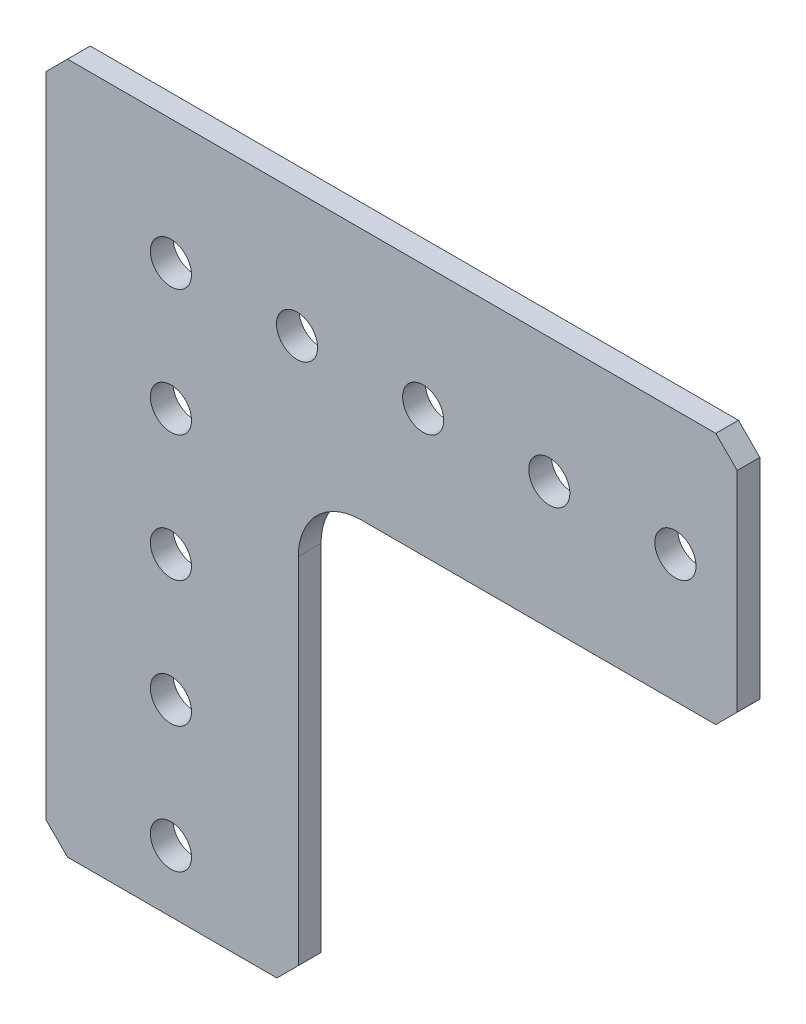
ISO-10303-21;
HEADER;
FILE_DESCRIPTION(('STEP AP214'),'2;1');
FILE_NAME('part.step','',(''),(''),'','','');
FILE_SCHEMA(('AUTOMOTIVE_DESIGN { 1 0 10303 214 1 1 1 1 }'));
ENDSEC;
DATA;
#1=APPLICATION_CONTEXT('core data for automotive mechanical design processes');
#2=APPLICATION_PROTOCOL_DEFINITION('international standard','automotive_design',2000,#1);
#3=PRODUCT_CONTEXT('',#1,'mechanical');
#4=PRODUCT('Part','Part','',(#3));
#5=PRODUCT_RELATED_PRODUCT_CATEGORY('part','',(#4));
#6=PRODUCT_DEFINITION_FORMATION('','',#4);
#7=PRODUCT_DEFINITION_CONTEXT('part definition',#1,'design');
#8=PRODUCT_DEFINITION('design','',#6,#7);
#9=PRODUCT_DEFINITION_SHAPE('','',#8);
#10=(LENGTH_UNIT() NAMED_UNIT(*) SI_UNIT(.MILLI.,.METRE.));
#11=(NAMED_UNIT(*) PLANE_ANGLE_UNIT() SI_UNIT($,.RADIAN.));
#12=(NAMED_UNIT(*) SI_UNIT($,.STERADIAN.) SOLID_ANGLE_UNIT());
#13=UNCERTAINTY_MEASURE_WITH_UNIT(LENGTH_MEASURE(1.E-05),#10,'distance_accuracy_value','');
#14=(GEOMETRIC_REPRESENTATION_CONTEXT(3) GLOBAL_UNCERTAINTY_ASSIGNED_CONTEXT((#13)) GLOBAL_UNIT_ASSIGNED_CONTEXT((#10,
#11,#12)) REPRESENTATION_CONTEXT('',''));
#15=CARTESIAN_POINT('',(0.,0.,0.));
#16=DIRECTION('',(0.,0.,1.));
#17=DIRECTION('',(1.,0.,0.));
#18=AXIS2_PLACEMENT_3D('',#15,#16,#17);
#19=CARTESIAN_POINT('',(-12.573,10.414,2.286));
#20=DIRECTION('',(-0.707106781186548,0.707106781186547,0.));
#21=DIRECTION('',(-0.707106781186547,-0.707106781186548,0.));
#22=AXIS2_PLACEMENT_3D('',#19,#20,#21);
#23=PLANE('',#22);
#24=DIRECTION('',(0.707106781186547,0.707106781186548,0.));
#25=VECTOR('',#24,1.);
#26=CARTESIAN_POINT('',(-12.573,10.414,0.));
#27=LINE('',#26,#25);
#28=CARTESIAN_POINT('',(-12.573,10.414,0.));
#29=VERTEX_POINT('',#28);
#30=CARTESIAN_POINT('',(-10.414,12.573,0.));
#31=VERTEX_POINT('',#30);
#32=EDGE_CURVE('E157',#29,#31,#27,.T.);
#33=ORIENTED_EDGE('',*,*,#32,.F.);
#34=DIRECTION('',(0.,0.,-1.));
#35=VECTOR('',#34,1.);
#36=CARTESIAN_POINT('',(-12.573,10.414,2.286));
#37=LINE('',#36,#35);
#38=CARTESIAN_POINT('',(-12.573,10.414,2.286));
#39=VERTEX_POINT('',#38);
#40=EDGE_CURVE('E11',#39,#29,#37,.T.);
#41=ORIENTED_EDGE('',*,*,#40,.F.);
#42=DIRECTION('',(0.707106781186547,0.707106781186548,0.));
#43=VECTOR('',#42,1.);
#44=CARTESIAN_POINT('',(-12.573,10.414,2.286));
#45=LINE('',#44,#43);
#46=CARTESIAN_POINT('',(-10.414,12.573,2.286));
#47=VERTEX_POINT('',#46);
#48=EDGE_CURVE('E190',#39,#47,#45,.T.);
#49=ORIENTED_EDGE('',*,*,#48,.T.);
#50=DIRECTION('',(0.,0.,-1.));
#51=VECTOR('',#50,1.);
#52=CARTESIAN_POINT('',(-10.414,12.573,2.286));
#53=LINE('',#52,#51);
#54=EDGE_CURVE('E39',#47,#31,#53,.T.);
#55=ORIENTED_EDGE('',*,*,#54,.T.);
#56=EDGE_LOOP('',(#33,#41,#49,#55));
#57=FACE_BOUND('',#56,.T.);
#58=ADVANCED_FACE('F36',(#57),#23,.T.);
#59=CARTESIAN_POINT('',(-12.573,-54.864,2.286));
#60=DIRECTION('',(-1.,0.,0.));
#61=DIRECTION('',(0.,-1.,0.));
#62=AXIS2_PLACEMENT_3D('',#59,#60,#61);
#63=PLANE('',#62);
#64=DIRECTION('',(0.,1.,0.));
#65=VECTOR('',#64,1.);
#66=CARTESIAN_POINT('',(-12.573,-54.864,0.));
#67=LINE('',#66,#65);
#68=CARTESIAN_POINT('',(-12.573,-54.864,0.));
#69=VERTEX_POINT('',#68);
#70=EDGE_CURVE('E188',#69,#29,#67,.T.);
#71=ORIENTED_EDGE('',*,*,#70,.F.);
#72=DIRECTION('',(0.,0.,-1.));
#73=VECTOR('',#72,1.);
#74=CARTESIAN_POINT('',(-12.573,-54.864,2.286));
#75=LINE('',#74,#73);
#76=CARTESIAN_POINT('',(-12.573,-54.864,2.286));
#77=VERTEX_POINT('',#76);
#78=EDGE_CURVE('E45',#77,#69,#75,.T.);
#79=ORIENTED_EDGE('',*,*,#78,.F.);
#80=DIRECTION('',(0.,1.,0.));
#81=VECTOR('',#80,1.);
#82=CARTESIAN_POINT('',(-12.573,-54.864,2.286));
#83=LINE('',#82,#81);
#84=EDGE_CURVE('E147',#77,#39,#83,.T.);
#85=ORIENTED_EDGE('',*,*,#84,.T.);
#86=ORIENTED_EDGE('',*,*,#40,.T.);
#87=EDGE_LOOP('',(#71,#79,#85,#86));
#88=FACE_BOUND('',#87,.T.);
#89=ADVANCED_FACE('F210',(#88),#63,.T.);
#90=CARTESIAN_POINT('',(-10.414,-57.023,2.286));
#91=DIRECTION('',(-0.707106781186544,-0.707106781186551,0.));
#92=DIRECTION('',(0.707106781186551,-0.707106781186544,0.));
#93=AXIS2_PLACEMENT_3D('',#90,#91,#92);
#94=PLANE('',#93);
#95=DIRECTION('',(-0.707106781186551,0.707106781186544,0.));
#96=VECTOR('',#95,1.);
#97=CARTESIAN_POINT('',(-10.414,-57.023,0.));
#98=LINE('',#97,#96);
#99=CARTESIAN_POINT('',(-10.414,-57.023,0.));
#100=VERTEX_POINT('',#99);
#101=EDGE_CURVE('E134',#100,#69,#98,.T.);
#102=ORIENTED_EDGE('',*,*,#101,.F.);
#103=DIRECTION('',(0.,0.,-1.));
#104=VECTOR('',#103,1.);
#105=CARTESIAN_POINT('',(-10.414,-57.023,2.286));
#106=LINE('',#105,#104);
#107=CARTESIAN_POINT('',(-10.414,-57.023,2.286));
#108=VERTEX_POINT('',#107);
#109=EDGE_CURVE('E129',#108,#100,#106,.T.);
#110=ORIENTED_EDGE('',*,*,#109,.F.);
#111=DIRECTION('',(-0.707106781186551,0.707106781186544,0.));
#112=VECTOR('',#111,1.);
#113=CARTESIAN_POINT('',(-10.414,-57.023,2.286));
#114=LINE('',#113,#112);
#115=EDGE_CURVE('E132',#108,#77,#114,.T.);
#116=ORIENTED_EDGE('',*,*,#115,.T.);
#117=ORIENTED_EDGE('',*,*,#78,.T.);
#118=EDGE_LOOP('',(#102,#110,#116,#117));
#119=FACE_BOUND('',#118,.T.);
#120=ADVANCED_FACE('F131',(#119),#94,.T.);
#121=CARTESIAN_POINT('',(10.668,-57.023,2.286));
#122=DIRECTION('',(0.,-1.,0.));
#123=DIRECTION('',(1.,0.,0.));
#124=AXIS2_PLACEMENT_3D('',#121,#122,#123);
#125=PLANE('',#124);
#126=DIRECTION('',(-1.,0.,0.));
#127=VECTOR('',#126,1.);
#128=CARTESIAN_POINT('',(10.668,-57.023,0.));
#129=LINE('',#128,#127);
#130=CARTESIAN_POINT('',(10.668,-57.023,0.));
#131=VERTEX_POINT('',#130);
#132=EDGE_CURVE('E185',#131,#100,#129,.T.);
#133=ORIENTED_EDGE('',*,*,#132,.F.);
#134=DIRECTION('',(0.,0.,-1.));
#135=VECTOR('',#134,1.);
#136=CARTESIAN_POINT('',(10.668,-57.023,2.286));
#137=LINE('',#136,#135);
#138=CARTESIAN_POINT('',(10.668,-57.023,2.286));
#139=VERTEX_POINT('',#138);
#140=EDGE_CURVE('E139',#139,#131,#137,.T.);
#141=ORIENTED_EDGE('',*,*,#140,.F.);
#142=DIRECTION('',(-1.,0.,0.));
#143=VECTOR('',#142,1.);
#144=CARTESIAN_POINT('',(10.668,-57.023,2.286));
#145=LINE('',#144,#143);
#146=EDGE_CURVE('E145',#139,#108,#145,.T.);
#147=ORIENTED_EDGE('',*,*,#146,.T.);
#148=ORIENTED_EDGE('',*,*,#109,.T.);
#149=EDGE_LOOP('',(#133,#141,#147,#148));
#150=FACE_BOUND('',#149,.T.);
#151=ADVANCED_FACE('F149',(#150),#125,.T.);
#152=CARTESIAN_POINT('',(12.827,-54.864,2.286));
#153=DIRECTION('',(0.707106781186548,-0.707106781186547,0.));
#154=DIRECTION('',(0.707106781186547,0.707106781186548,0.));
#155=AXIS2_PLACEMENT_3D('',#152,#153,#154);
#156=PLANE('',#155);
#157=DIRECTION('',(-0.707106781186547,-0.707106781186548,0.));
#158=VECTOR('',#157,1.);
#159=CARTESIAN_POINT('',(12.827,-54.864,0.));
#160=LINE('',#159,#158);
#161=CARTESIAN_POINT('',(12.827,-54.864,0.));
#162=VERTEX_POINT('',#161);
#163=EDGE_CURVE('E182',#162,#131,#160,.T.);
#164=ORIENTED_EDGE('',*,*,#163,.F.);
#165=DIRECTION('',(0.,0.,-1.));
#166=VECTOR('',#165,1.);
#167=CARTESIAN_POINT('',(12.827,-54.864,2.286));
#168=LINE('',#167,#166);
#169=CARTESIAN_POINT('',(12.827,-54.864,2.286));
#170=VERTEX_POINT('',#169);
#171=EDGE_CURVE('E194',#170,#162,#168,.T.);
#172=ORIENTED_EDGE('',*,*,#171,.F.);
#173=DIRECTION('',(-0.707106781186547,-0.707106781186548,0.));
#174=VECTOR('',#173,1.);
#175=CARTESIAN_POINT('',(12.827,-54.864,2.286));
#176=LINE('',#175,#174);
#177=EDGE_CURVE('E150',#170,#139,#176,.T.);
#178=ORIENTED_EDGE('',*,*,#177,.T.);
#179=ORIENTED_EDGE('',*,*,#140,.T.);
#180=EDGE_LOOP('',(#164,#172,#178,#179));
#181=FACE_BOUND('',#180,.T.);
#182=ADVANCED_FACE('F223',(#181),#156,.T.);
#183=CARTESIAN_POINT('',(12.827,-19.177,2.286));
#184=DIRECTION('',(1.,0.,0.));
#185=DIRECTION('',(0.,0.,-1.));
#186=AXIS2_PLACEMENT_3D('',#183,#184,#185);
#187=PLANE('',#186);
#188=DIRECTION('',(0.,-1.,0.));
#189=VECTOR('',#188,1.);
#190=CARTESIAN_POINT('',(12.827,-19.177,0.));
#191=LINE('',#190,#189);
#192=CARTESIAN_POINT('',(12.827,-19.177,0.));
#193=VERTEX_POINT('',#192);
#194=EDGE_CURVE('E179',#193,#162,#191,.T.);
#195=ORIENTED_EDGE('',*,*,#194,.F.);
#196=DIRECTION('',(0.,0.,-1.));
#197=VECTOR('',#196,1.);
#198=CARTESIAN_POINT('',(12.827,-19.177,2.286));
#199=LINE('',#198,#197);
#200=CARTESIAN_POINT('',(12.827,-19.177,2.286));
#201=VERTEX_POINT('',#200);
#202=EDGE_CURVE('E196',#201,#193,#199,.T.);
#203=ORIENTED_EDGE('',*,*,#202,.F.);
#204=DIRECTION('',(0.,-1.,0.));
#205=VECTOR('',#204,1.);
#206=CARTESIAN_POINT('',(12.827,-19.177,2.286));
#207=LINE('',#206,#205);
#208=EDGE_CURVE('E152',#201,#170,#207,.T.);
#209=ORIENTED_EDGE('',*,*,#208,.T.);
#210=ORIENTED_EDGE('',*,*,#171,.T.);
#211=EDGE_LOOP('',(#195,#203,#209,#210));
#212=FACE_BOUND('',#211,.T.);
#213=ADVANCED_FACE('F226',(#212),#187,.T.);
#214=CARTESIAN_POINT('',(19.177,-19.177,2.286));
#215=DIRECTION('',(0.,0.,-1.));
#216=DIRECTION('',(-1.,0.,0.));
#217=AXIS2_PLACEMENT_3D('',#214,#215,#216);
#218=CYLINDRICAL_SURFACE('',#217,6.35);
#219=CARTESIAN_POINT('',(19.177,-19.177,0.));
#220=DIRECTION('',(0.,0.,1.));
#221=DIRECTION('',(1.,0.,0.));
#222=AXIS2_PLACEMENT_3D('',#219,#220,#221);
#223=CIRCLE('',#222,6.35);
#224=CARTESIAN_POINT('',(19.177,-12.827,0.));
#225=VERTEX_POINT('',#224);
#226=EDGE_CURVE('E176',#225,#193,#223,.T.);
#227=ORIENTED_EDGE('',*,*,#226,.F.);
#228=DIRECTION('',(0.,0.,-1.));
#229=VECTOR('',#228,1.);
#230=CARTESIAN_POINT('',(19.177,-12.827,2.286));
#231=LINE('',#230,#229);
#232=CARTESIAN_POINT('',(19.177,-12.827,2.286));
#233=VERTEX_POINT('',#232);
#234=EDGE_CURVE('E198',#233,#225,#231,.T.);
#235=ORIENTED_EDGE('',*,*,#234,.F.);
#236=CARTESIAN_POINT('',(19.177,-19.177,2.286));
#237=DIRECTION('',(0.,0.,1.));
#238=DIRECTION('',(1.,0.,0.));
#239=AXIS2_PLACEMENT_3D('',#236,#237,#238);
#240=CIRCLE('',#239,6.35);
#241=EDGE_CURVE('E370',#233,#201,#240,.T.);
#242=ORIENTED_EDGE('',*,*,#241,.T.);
#243=ORIENTED_EDGE('',*,*,#202,.T.);
#244=EDGE_LOOP('',(#227,#235,#242,#243));
#245=FACE_BOUND('',#244,.T.);
#246=ADVANCED_FACE('F230',(#245),#218,.F.);
#247=CARTESIAN_POINT('',(54.864,-12.827,2.286));
#248=DIRECTION('',(0.,-1.,0.));
#249=DIRECTION('',(0.,0.,-1.));
#250=AXIS2_PLACEMENT_3D('',#247,#248,#249);
#251=PLANE('',#250);
#252=DIRECTION('',(-1.,0.,0.));
#253=VECTOR('',#252,1.);
#254=CARTESIAN_POINT('',(54.864,-12.827,0.));
#255=LINE('',#254,#253);
#256=CARTESIAN_POINT('',(54.864,-12.827,0.));
#257=VERTEX_POINT('',#256);
#258=EDGE_CURVE('E173',#257,#225,#255,.T.);
#259=ORIENTED_EDGE('',*,*,#258,.F.);
#260=DIRECTION('',(0.,0.,-1.));
#261=VECTOR('',#260,1.);
#262=CARTESIAN_POINT('',(54.864,-12.827,2.286));
#263=LINE('',#262,#261);
#264=CARTESIAN_POINT('',(54.864,-12.827,2.286));
#265=VERTEX_POINT('',#264);
#266=EDGE_CURVE('E200',#265,#257,#263,.T.);
#267=ORIENTED_EDGE('',*,*,#266,.F.);
#268=DIRECTION('',(-1.,0.,0.));
#269=VECTOR('',#268,1.);
#270=CARTESIAN_POINT('',(54.864,-12.827,2.286));
#271=LINE('',#270,#269);
#272=EDGE_CURVE('E367',#265,#233,#271,.T.);
#273=ORIENTED_EDGE('',*,*,#272,.T.);
#274=ORIENTED_EDGE('',*,*,#234,.T.);
#275=EDGE_LOOP('',(#259,#267,#273,#274));
#276=FACE_BOUND('',#275,.T.);
#277=ADVANCED_FACE('F234',(#276),#251,.T.);
#278=CARTESIAN_POINT('',(57.023,-10.668,2.286));
#279=DIRECTION('',(0.707106781186548,-0.707106781186546,0.));
#280=DIRECTION('',(0.707106781186547,0.707106781186548,0.));
#281=AXIS2_PLACEMENT_3D('',#278,#279,#280);
#282=PLANE('',#281);
#283=DIRECTION('',(-0.707106781186547,-0.707106781186548,0.));
#284=VECTOR('',#283,1.);
#285=CARTESIAN_POINT('',(57.023,-10.668,0.));
#286=LINE('',#285,#284);
#287=CARTESIAN_POINT('',(57.023,-10.668,0.));
#288=VERTEX_POINT('',#287);
#289=EDGE_CURVE('E170',#288,#257,#286,.T.);
#290=ORIENTED_EDGE('',*,*,#289,.F.);
#291=DIRECTION('',(0.,0.,-1.));
#292=VECTOR('',#291,1.);
#293=CARTESIAN_POINT('',(57.023,-10.668,2.286));
#294=LINE('',#293,#292);
#295=CARTESIAN_POINT('',(57.023,-10.668,2.286));
#296=VERTEX_POINT('',#295);
#297=EDGE_CURVE('E202',#296,#288,#294,.T.);
#298=ORIENTED_EDGE('',*,*,#297,.F.);
#299=DIRECTION('',(-0.707106781186547,-0.707106781186548,0.));
#300=VECTOR('',#299,1.);
#301=CARTESIAN_POINT('',(57.023,-10.668,2.286));
#302=LINE('',#301,#300);
#303=EDGE_CURVE('E364',#296,#265,#302,.T.);
#304=ORIENTED_EDGE('',*,*,#303,.T.);
#305=ORIENTED_EDGE('',*,*,#266,.T.);
#306=EDGE_LOOP('',(#290,#298,#304,#305));
#307=FACE_BOUND('',#306,.T.);
#308=ADVANCED_FACE('F238',(#307),#282,.T.);
#309=CARTESIAN_POINT('',(57.023,10.414,2.286));
#310=DIRECTION('',(1.,0.,0.));
#311=DIRECTION('',(0.,1.,0.));
#312=AXIS2_PLACEMENT_3D('',#309,#310,#311);
#313=PLANE('',#312);
#314=DIRECTION('',(0.,-1.,0.));
#315=VECTOR('',#314,1.);
#316=CARTESIAN_POINT('',(57.023,10.414,0.));
#317=LINE('',#316,#315);
#318=CARTESIAN_POINT('',(57.023,10.414,0.));
#319=VERTEX_POINT('',#318);
#320=EDGE_CURVE('E167',#319,#288,#317,.T.);
#321=ORIENTED_EDGE('',*,*,#320,.F.);
#322=DIRECTION('',(0.,0.,-1.));
#323=VECTOR('',#322,1.);
#324=CARTESIAN_POINT('',(57.023,10.414,2.286));
#325=LINE('',#324,#323);
#326=CARTESIAN_POINT('',(57.023,10.414,2.286));
#327=VERTEX_POINT('',#326);
#328=EDGE_CURVE('E204',#327,#319,#325,.T.);
#329=ORIENTED_EDGE('',*,*,#328,.F.);
#330=DIRECTION('',(0.,-1.,0.));
#331=VECTOR('',#330,1.);
#332=CARTESIAN_POINT('',(57.023,10.414,2.286));
#333=LINE('',#332,#331);
#334=EDGE_CURVE('E361',#327,#296,#333,.T.);
#335=ORIENTED_EDGE('',*,*,#334,.T.);
#336=ORIENTED_EDGE('',*,*,#297,.T.);
#337=EDGE_LOOP('',(#321,#329,#335,#336));
#338=FACE_BOUND('',#337,.T.);
#339=ADVANCED_FACE('F242',(#338),#313,.T.);
#340=CARTESIAN_POINT('',(54.864,12.573,2.286));
#341=DIRECTION('',(0.707106781186544,0.70710678118655,0.));
#342=DIRECTION('',(-0.707106781186551,0.707106781186544,0.));
#343=AXIS2_PLACEMENT_3D('',#340,#341,#342);
#344=PLANE('',#343);
#345=DIRECTION('',(0.707106781186551,-0.707106781186544,0.));
#346=VECTOR('',#345,1.);
#347=CARTESIAN_POINT('',(54.864,12.573,0.));
#348=LINE('',#347,#346);
#349=CARTESIAN_POINT('',(54.864,12.573,0.));
#350=VERTEX_POINT('',#349);
#351=EDGE_CURVE('E164',#350,#319,#348,.T.);
#352=ORIENTED_EDGE('',*,*,#351,.F.);
#353=DIRECTION('',(0.,0.,-1.));
#354=VECTOR('',#353,1.);
#355=CARTESIAN_POINT('',(54.864,12.573,2.286));
#356=LINE('',#355,#354);
#357=CARTESIAN_POINT('',(54.864,12.573,2.286));
#358=VERTEX_POINT('',#357);
#359=EDGE_CURVE('E205',#358,#350,#356,.T.);
#360=ORIENTED_EDGE('',*,*,#359,.F.);
#361=DIRECTION('',(0.707106781186551,-0.707106781186544,0.));
#362=VECTOR('',#361,1.);
#363=CARTESIAN_POINT('',(54.864,12.573,2.286));
#364=LINE('',#363,#362);
#365=EDGE_CURVE('E358',#358,#327,#364,.T.);
#366=ORIENTED_EDGE('',*,*,#365,.T.);
#367=ORIENTED_EDGE('',*,*,#328,.T.);
#368=EDGE_LOOP('',(#352,#360,#366,#367));
#369=FACE_BOUND('',#368,.T.);
#370=ADVANCED_FACE('F246',(#369),#344,.T.);
#371=CARTESIAN_POINT('',(-10.414,12.573,2.286));
#372=DIRECTION('',(0.,1.,0.));
#373=DIRECTION('',(-1.,0.,0.));
#374=AXIS2_PLACEMENT_3D('',#371,#372,#373);
#375=PLANE('',#374);
#376=DIRECTION('',(1.,0.,0.));
#377=VECTOR('',#376,1.);
#378=CARTESIAN_POINT('',(-10.414,12.573,0.));
#379=LINE('',#378,#377);
#380=EDGE_CURVE('E160',#31,#350,#379,.T.);
#381=ORIENTED_EDGE('',*,*,#380,.F.);
#382=ORIENTED_EDGE('',*,*,#54,.F.);
#383=DIRECTION('',(1.,0.,0.));
#384=VECTOR('',#383,1.);
#385=CARTESIAN_POINT('',(-10.414,12.573,2.286));
#386=LINE('',#385,#384);
#387=EDGE_CURVE('E356',#47,#358,#386,.T.);
#388=ORIENTED_EDGE('',*,*,#387,.T.);
#389=ORIENTED_EDGE('',*,*,#359,.T.);
#390=EDGE_LOOP('',(#381,#382,#388,#389));
#391=FACE_BOUND('',#390,.T.);
#392=ADVANCED_FACE('F207',(#391),#375,.T.);
#393=CARTESIAN_POINT('',(19.177,-19.177,2.286));
#394=DIRECTION('',(0.,0.,1.));
#395=DIRECTION('',(1.,0.,0.));
#396=AXIS2_PLACEMENT_3D('',#393,#394,#395);
#397=PLANE('',#396);
#398=CARTESIAN_POINT('',(50.8,0.,2.286));
#399=DIRECTION('',(0.,0.,-1.));
#400=DIRECTION('',(1.,0.,0.));
#401=AXIS2_PLACEMENT_3D('',#398,#399,#400);
#402=CIRCLE('',#401,2.0701);
#403=CARTESIAN_POINT('',(52.8701,0.,2.286));
#404=VERTEX_POINT('',#403);
#405=EDGE_CURVE('E301',#404,#404,#402,.T.);
#406=ORIENTED_EDGE('',*,*,#405,.T.);
#407=EDGE_LOOP('',(#406));
#408=FACE_BOUND('',#407,.T.);
#409=CARTESIAN_POINT('',(3.9907631702977E-13,-38.1,2.286));
#410=DIRECTION('',(0.,0.,-1.));
#411=DIRECTION('',(1.,0.,0.));
#412=AXIS2_PLACEMENT_3D('',#409,#410,#411);
#413=CIRCLE('',#412,2.0701);
#414=CARTESIAN_POINT('',(2.0701000000004,-38.1,2.286));
#415=VERTEX_POINT('',#414);
#416=EDGE_CURVE('E309',#415,#415,#413,.T.);
#417=ORIENTED_EDGE('',*,*,#416,.T.);
#418=EDGE_LOOP('',(#417));
#419=FACE_BOUND('',#418,.T.);
#420=CARTESIAN_POINT('',(1.33025439009923E-13,-12.7,2.286));
#421=DIRECTION('',(0.,0.,-1.));
#422=DIRECTION('',(1.,0.,0.));
#423=AXIS2_PLACEMENT_3D('',#420,#421,#422);
#424=CIRCLE('',#423,2.0701);
#425=CARTESIAN_POINT('',(2.07010000000013,-12.7,2.286));
#426=VERTEX_POINT('',#425);
#427=EDGE_CURVE('E315',#426,#426,#424,.T.);
#428=ORIENTED_EDGE('',*,*,#427,.T.);
#429=EDGE_LOOP('',(#428));
#430=FACE_BOUND('',#429,.T.);
#431=CARTESIAN_POINT('',(25.4,3.54734504026462E-13,2.286));
#432=DIRECTION('',(0.,0.,-1.));
#433=DIRECTION('',(1.,0.,0.));
#434=AXIS2_PLACEMENT_3D('',#431,#432,#433);
#435=CIRCLE('',#434,2.0701);
#436=CARTESIAN_POINT('',(27.4701,3.54734504026462E-13,2.286));
#437=VERTEX_POINT('',#436);
#438=EDGE_CURVE('E321',#437,#437,#435,.T.);
#439=ORIENTED_EDGE('',*,*,#438,.T.);
#440=EDGE_LOOP('',(#439));
#441=FACE_BOUND('',#440,.T.);
#442=CARTESIAN_POINT('',(0.,0.,2.286));
#443=DIRECTION('',(0.,0.,-1.));
#444=DIRECTION('',(1.,0.,0.));
#445=AXIS2_PLACEMENT_3D('',#442,#443,#444);
#446=CIRCLE('',#445,2.0701);
#447=CARTESIAN_POINT('',(2.0701,0.,2.286));
#448=VERTEX_POINT('',#447);
#449=EDGE_CURVE('E327',#448,#448,#446,.T.);
#450=ORIENTED_EDGE('',*,*,#449,.T.);
#451=EDGE_LOOP('',(#450));
#452=FACE_BOUND('',#451,.T.);
#453=CARTESIAN_POINT('',(12.7,1.77367252013231E-13,2.286));
#454=DIRECTION('',(0.,0.,-1.));
#455=DIRECTION('',(1.,0.,0.));
#456=AXIS2_PLACEMENT_3D('',#453,#454,#455);
#457=CIRCLE('',#456,2.0701);
#458=CARTESIAN_POINT('',(14.7701,1.77367252013231E-13,2.286));
#459=VERTEX_POINT('',#458);
#460=EDGE_CURVE('E333',#459,#459,#457,.T.);
#461=ORIENTED_EDGE('',*,*,#460,.T.);
#462=EDGE_LOOP('',(#461));
#463=FACE_BOUND('',#462,.T.);
#464=CARTESIAN_POINT('',(38.1,0.,2.286));
#465=DIRECTION('',(0.,0.,-1.));
#466=DIRECTION('',(1.,0.,0.));
#467=AXIS2_PLACEMENT_3D('',#464,#465,#466);
#468=CIRCLE('',#467,2.0701);
#469=CARTESIAN_POINT('',(40.1701,0.,2.286));
#470=VERTEX_POINT('',#469);
#471=EDGE_CURVE('E339',#470,#470,#468,.T.);
#472=ORIENTED_EDGE('',*,*,#471,.T.);
#473=EDGE_LOOP('',(#472));
#474=FACE_BOUND('',#473,.T.);
#475=CARTESIAN_POINT('',(2.66050878019847E-13,-25.4,2.286));
#476=DIRECTION('',(0.,0.,-1.));
#477=DIRECTION('',(1.,0.,0.));
#478=AXIS2_PLACEMENT_3D('',#475,#476,#477);
#479=CIRCLE('',#478,2.0701);
#480=CARTESIAN_POINT('',(2.07010000000027,-25.4,2.286));
#481=VERTEX_POINT('',#480);
#482=EDGE_CURVE('E345',#481,#481,#479,.T.);
#483=ORIENTED_EDGE('',*,*,#482,.T.);
#484=EDGE_LOOP('',(#483));
#485=FACE_BOUND('',#484,.T.);
#486=CARTESIAN_POINT('',(0.,-50.8,2.286));
#487=DIRECTION('',(0.,0.,-1.));
#488=DIRECTION('',(1.,0.,0.));
#489=AXIS2_PLACEMENT_3D('',#486,#487,#488);
#490=CIRCLE('',#489,2.0701);
#491=CARTESIAN_POINT('',(2.07010000000001,-50.8,2.286));
#492=VERTEX_POINT('',#491);
#493=EDGE_CURVE('E161',#492,#492,#490,.T.);
#494=ORIENTED_EDGE('',*,*,#493,.T.);
#495=EDGE_LOOP('',(#494));
#496=FACE_BOUND('',#495,.T.);
#497=ORIENTED_EDGE('',*,*,#48,.F.);
#498=ORIENTED_EDGE('',*,*,#84,.F.);
#499=ORIENTED_EDGE('',*,*,#115,.F.);
#500=ORIENTED_EDGE('',*,*,#146,.F.);
#501=ORIENTED_EDGE('',*,*,#177,.F.);
#502=ORIENTED_EDGE('',*,*,#208,.F.);
#503=ORIENTED_EDGE('',*,*,#241,.F.);
#504=ORIENTED_EDGE('',*,*,#272,.F.);
#505=ORIENTED_EDGE('',*,*,#303,.F.);
#506=ORIENTED_EDGE('',*,*,#334,.F.);
#507=ORIENTED_EDGE('',*,*,#365,.F.);
#508=ORIENTED_EDGE('',*,*,#387,.F.);
#509=EDGE_LOOP('',(#497,#498,#499,#500,#501,#502,#503,#504,#505,#506,#507,#508));
#510=FACE_BOUND('',#509,.T.);
#511=ADVANCED_FACE('F143',(#408,#419,#430,#441,#452,#463,#474,#485,#496,#510),#397,.T.);
#512=CARTESIAN_POINT('',(19.177,-19.177,0.));
#513=DIRECTION('',(0.,0.,1.));
#514=DIRECTION('',(1.,0.,0.));
#515=AXIS2_PLACEMENT_3D('',#512,#513,#514);
#516=PLANE('',#515);
#517=CARTESIAN_POINT('',(50.8,0.,0.));
#518=DIRECTION('',(0.,0.,-1.));
#519=DIRECTION('',(1.,0.,0.));
#520=AXIS2_PLACEMENT_3D('',#517,#518,#519);
#521=CIRCLE('',#520,2.0701);
#522=CARTESIAN_POINT('',(52.8701,0.,0.));
#523=VERTEX_POINT('',#522);
#524=EDGE_CURVE('E304',#523,#523,#521,.T.);
#525=ORIENTED_EDGE('',*,*,#524,.F.);
#526=EDGE_LOOP('',(#525));
#527=FACE_BOUND('',#526,.T.);
#528=CARTESIAN_POINT('',(3.9907631702977E-13,-38.1,0.));
#529=DIRECTION('',(0.,0.,-1.));
#530=DIRECTION('',(1.,0.,0.));
#531=AXIS2_PLACEMENT_3D('',#528,#529,#530);
#532=CIRCLE('',#531,2.0701);
#533=CARTESIAN_POINT('',(2.0701000000004,-38.1,0.));
#534=VERTEX_POINT('',#533);
#535=EDGE_CURVE('E306',#534,#534,#532,.T.);
#536=ORIENTED_EDGE('',*,*,#535,.F.);
#537=EDGE_LOOP('',(#536));
#538=FACE_BOUND('',#537,.T.);
#539=CARTESIAN_POINT('',(1.33025439009923E-13,-12.7,0.));
#540=DIRECTION('',(0.,0.,-1.));
#541=DIRECTION('',(1.,0.,0.));
#542=AXIS2_PLACEMENT_3D('',#539,#540,#541);
#543=CIRCLE('',#542,2.0701);
#544=CARTESIAN_POINT('',(2.07010000000013,-12.7,0.));
#545=VERTEX_POINT('',#544);
#546=EDGE_CURVE('E312',#545,#545,#543,.T.);
#547=ORIENTED_EDGE('',*,*,#546,.F.);
#548=EDGE_LOOP('',(#547));
#549=FACE_BOUND('',#548,.T.);
#550=CARTESIAN_POINT('',(25.4,3.54734504026462E-13,0.));
#551=DIRECTION('',(0.,0.,-1.));
#552=DIRECTION('',(1.,0.,0.));
#553=AXIS2_PLACEMENT_3D('',#550,#551,#552);
#554=CIRCLE('',#553,2.0701);
#555=CARTESIAN_POINT('',(27.4701,3.54734504026462E-13,0.));
#556=VERTEX_POINT('',#555);
#557=EDGE_CURVE('E318',#556,#556,#554,.T.);
#558=ORIENTED_EDGE('',*,*,#557,.F.);
#559=EDGE_LOOP('',(#558));
#560=FACE_BOUND('',#559,.T.);
#561=CARTESIAN_POINT('',(0.,0.,0.));
#562=DIRECTION('',(0.,0.,-1.));
#563=DIRECTION('',(1.,0.,0.));
#564=AXIS2_PLACEMENT_3D('',#561,#562,#563);
#565=CIRCLE('',#564,2.0701);
#566=CARTESIAN_POINT('',(2.0701,0.,0.));
#567=VERTEX_POINT('',#566);
#568=EDGE_CURVE('E324',#567,#567,#565,.T.);
#569=ORIENTED_EDGE('',*,*,#568,.F.);
#570=EDGE_LOOP('',(#569));
#571=FACE_BOUND('',#570,.T.);
#572=CARTESIAN_POINT('',(12.7,1.77367252013231E-13,0.));
#573=DIRECTION('',(0.,0.,-1.));
#574=DIRECTION('',(1.,0.,0.));
#575=AXIS2_PLACEMENT_3D('',#572,#573,#574);
#576=CIRCLE('',#575,2.0701);
#577=CARTESIAN_POINT('',(14.7701,1.77367252013231E-13,0.));
#578=VERTEX_POINT('',#577);
#579=EDGE_CURVE('E330',#578,#578,#576,.T.);
#580=ORIENTED_EDGE('',*,*,#579,.F.);
#581=EDGE_LOOP('',(#580));
#582=FACE_BOUND('',#581,.T.);
#583=CARTESIAN_POINT('',(38.1,0.,0.));
#584=DIRECTION('',(0.,0.,-1.));
#585=DIRECTION('',(1.,0.,0.));
#586=AXIS2_PLACEMENT_3D('',#583,#584,#585);
#587=CIRCLE('',#586,2.0701);
#588=CARTESIAN_POINT('',(40.1701,0.,0.));
#589=VERTEX_POINT('',#588);
#590=EDGE_CURVE('E336',#589,#589,#587,.T.);
#591=ORIENTED_EDGE('',*,*,#590,.F.);
#592=EDGE_LOOP('',(#591));
#593=FACE_BOUND('',#592,.T.);
#594=CARTESIAN_POINT('',(2.66050878019847E-13,-25.4,0.));
#595=DIRECTION('',(0.,0.,-1.));
#596=DIRECTION('',(1.,0.,0.));
#597=AXIS2_PLACEMENT_3D('',#594,#595,#596);
#598=CIRCLE('',#597,2.0701);
#599=CARTESIAN_POINT('',(2.07010000000027,-25.4,0.));
#600=VERTEX_POINT('',#599);
#601=EDGE_CURVE('E342',#600,#600,#598,.T.);
#602=ORIENTED_EDGE('',*,*,#601,.F.);
#603=EDGE_LOOP('',(#602));
#604=FACE_BOUND('',#603,.T.);
#605=CARTESIAN_POINT('',(0.,-50.8,0.));
#606=DIRECTION('',(0.,0.,-1.));
#607=DIRECTION('',(1.,0.,0.));
#608=AXIS2_PLACEMENT_3D('',#605,#606,#607);
#609=CIRCLE('',#608,2.0701);
#610=CARTESIAN_POINT('',(2.07010000000001,-50.8,0.));
#611=VERTEX_POINT('',#610);
#612=EDGE_CURVE('E348',#611,#611,#609,.T.);
#613=ORIENTED_EDGE('',*,*,#612,.F.);
#614=EDGE_LOOP('',(#613));
#615=FACE_BOUND('',#614,.T.);
#616=ORIENTED_EDGE('',*,*,#32,.T.);
#617=ORIENTED_EDGE('',*,*,#380,.T.);
#618=ORIENTED_EDGE('',*,*,#351,.T.);
#619=ORIENTED_EDGE('',*,*,#320,.T.);
#620=ORIENTED_EDGE('',*,*,#289,.T.);
#621=ORIENTED_EDGE('',*,*,#258,.T.);
#622=ORIENTED_EDGE('',*,*,#226,.T.);
#623=ORIENTED_EDGE('',*,*,#194,.T.);
#624=ORIENTED_EDGE('',*,*,#163,.T.);
#625=ORIENTED_EDGE('',*,*,#132,.T.);
#626=ORIENTED_EDGE('',*,*,#101,.T.);
#627=ORIENTED_EDGE('',*,*,#70,.T.);
#628=EDGE_LOOP('',(#616,#617,#618,#619,#620,#621,#622,#623,#624,#625,#626,#627));
#629=FACE_BOUND('',#628,.T.);
#630=ADVANCED_FACE('F209',(#527,#538,#549,#560,#571,#582,#593,#604,#615,#629),#516,.F.);
#631=CARTESIAN_POINT('',(0.,-50.8,2.286));
#632=DIRECTION('',(0.,0.,-1.));
#633=DIRECTION('',(-1.,0.,0.));
#634=AXIS2_PLACEMENT_3D('',#631,#632,#633);
#635=CYLINDRICAL_SURFACE('',#634,2.0701);
#636=ORIENTED_EDGE('',*,*,#493,.F.);
#637=EDGE_LOOP('',(#636));
#638=FACE_BOUND('',#637,.T.);
#639=ORIENTED_EDGE('',*,*,#612,.T.);
#640=EDGE_LOOP('',(#639));
#641=FACE_BOUND('',#640,.T.);
#642=ADVANCED_FACE('F258',(#638,#641),#635,.F.);
#643=CARTESIAN_POINT('',(2.66050878019847E-13,-25.4,2.286));
#644=DIRECTION('',(0.,0.,-1.));
#645=DIRECTION('',(-1.,0.,0.));
#646=AXIS2_PLACEMENT_3D('',#643,#644,#645);
#647=CYLINDRICAL_SURFACE('',#646,2.0701);
#648=ORIENTED_EDGE('',*,*,#482,.F.);
#649=EDGE_LOOP('',(#648));
#650=FACE_BOUND('',#649,.T.);
#651=ORIENTED_EDGE('',*,*,#601,.T.);
#652=EDGE_LOOP('',(#651));
#653=FACE_BOUND('',#652,.T.);
#654=ADVANCED_FACE('F265',(#650,#653),#647,.F.);
#655=CARTESIAN_POINT('',(38.1,0.,2.286));
#656=DIRECTION('',(0.,0.,-1.));
#657=DIRECTION('',(-1.,0.,0.));
#658=AXIS2_PLACEMENT_3D('',#655,#656,#657);
#659=CYLINDRICAL_SURFACE('',#658,2.0701);
#660=ORIENTED_EDGE('',*,*,#471,.F.);
#661=EDGE_LOOP('',(#660));
#662=FACE_BOUND('',#661,.T.);
#663=ORIENTED_EDGE('',*,*,#590,.T.);
#664=EDGE_LOOP('',(#663));
#665=FACE_BOUND('',#664,.T.);
#666=ADVANCED_FACE('F269',(#662,#665),#659,.F.);
#667=CARTESIAN_POINT('',(12.7,1.77367252013231E-13,2.286));
#668=DIRECTION('',(0.,0.,-1.));
#669=DIRECTION('',(-1.,0.,0.));
#670=AXIS2_PLACEMENT_3D('',#667,#668,#669);
#671=CYLINDRICAL_SURFACE('',#670,2.0701);
#672=ORIENTED_EDGE('',*,*,#460,.F.);
#673=EDGE_LOOP('',(#672));
#674=FACE_BOUND('',#673,.T.);
#675=ORIENTED_EDGE('',*,*,#579,.T.);
#676=EDGE_LOOP('',(#675));
#677=FACE_BOUND('',#676,.T.);
#678=ADVANCED_FACE('F273',(#674,#677),#671,.F.);
#679=CARTESIAN_POINT('',(0.,0.,2.286));
#680=DIRECTION('',(0.,0.,-1.));
#681=DIRECTION('',(-1.,0.,0.));
#682=AXIS2_PLACEMENT_3D('',#679,#680,#681);
#683=CYLINDRICAL_SURFACE('',#682,2.0701);
#684=ORIENTED_EDGE('',*,*,#449,.F.);
#685=EDGE_LOOP('',(#684));
#686=FACE_BOUND('',#685,.T.);
#687=ORIENTED_EDGE('',*,*,#568,.T.);
#688=EDGE_LOOP('',(#687));
#689=FACE_BOUND('',#688,.T.);
#690=ADVANCED_FACE('F277',(#686,#689),#683,.F.);
#691=CARTESIAN_POINT('',(25.4,3.54734504026462E-13,2.286));
#692=DIRECTION('',(0.,0.,-1.));
#693=DIRECTION('',(-1.,0.,0.));
#694=AXIS2_PLACEMENT_3D('',#691,#692,#693);
#695=CYLINDRICAL_SURFACE('',#694,2.0701);
#696=ORIENTED_EDGE('',*,*,#438,.F.);
#697=EDGE_LOOP('',(#696));
#698=FACE_BOUND('',#697,.T.);
#699=ORIENTED_EDGE('',*,*,#557,.T.);
#700=EDGE_LOOP('',(#699));
#701=FACE_BOUND('',#700,.T.);
#702=ADVANCED_FACE('F281',(#698,#701),#695,.F.);
#703=CARTESIAN_POINT('',(1.33025439009923E-13,-12.7,2.286));
#704=DIRECTION('',(0.,0.,-1.));
#705=DIRECTION('',(-1.,0.,0.));
#706=AXIS2_PLACEMENT_3D('',#703,#704,#705);
#707=CYLINDRICAL_SURFACE('',#706,2.0701);
#708=ORIENTED_EDGE('',*,*,#427,.F.);
#709=EDGE_LOOP('',(#708));
#710=FACE_BOUND('',#709,.T.);
#711=ORIENTED_EDGE('',*,*,#546,.T.);
#712=EDGE_LOOP('',(#711));
#713=FACE_BOUND('',#712,.T.);
#714=ADVANCED_FACE('F285',(#710,#713),#707,.F.);
#715=CARTESIAN_POINT('',(3.9907631702977E-13,-38.1,2.286));
#716=DIRECTION('',(0.,0.,-1.));
#717=DIRECTION('',(-1.,0.,0.));
#718=AXIS2_PLACEMENT_3D('',#715,#716,#717);
#719=CYLINDRICAL_SURFACE('',#718,2.0701);
#720=ORIENTED_EDGE('',*,*,#416,.F.);
#721=EDGE_LOOP('',(#720));
#722=FACE_BOUND('',#721,.T.);
#723=ORIENTED_EDGE('',*,*,#535,.T.);
#724=EDGE_LOOP('',(#723));
#725=FACE_BOUND('',#724,.T.);
#726=ADVANCED_FACE('F289',(#722,#725),#719,.F.);
#727=CARTESIAN_POINT('',(50.8,0.,2.286));
#728=DIRECTION('',(0.,0.,-1.));
#729=DIRECTION('',(-1.,0.,0.));
#730=AXIS2_PLACEMENT_3D('',#727,#728,#729);
#731=CYLINDRICAL_SURFACE('',#730,2.0701);
#732=ORIENTED_EDGE('',*,*,#405,.F.);
#733=EDGE_LOOP('',(#732));
#734=FACE_BOUND('',#733,.T.);
#735=ORIENTED_EDGE('',*,*,#524,.T.);
#736=EDGE_LOOP('',(#735));
#737=FACE_BOUND('',#736,.T.);
#738=ADVANCED_FACE('F293',(#734,#737),#731,.F.);
#739=CLOSED_SHELL('',(#58,#89,#120,#151,#182,#213,#246,#277,#308,#339,#370,#392,#511,#630,#642,
#654,#666,#678,#690,#702,#714,#726,#738));
#740=MANIFOLD_SOLID_BREP('B2',#739);
#741=ADVANCED_BREP_SHAPE_REPRESENTATION('',(#18,#740),#14);
#742=SHAPE_DEFINITION_REPRESENTATION(#9,#741);
ENDSEC;
END-ISO-10303-21;
